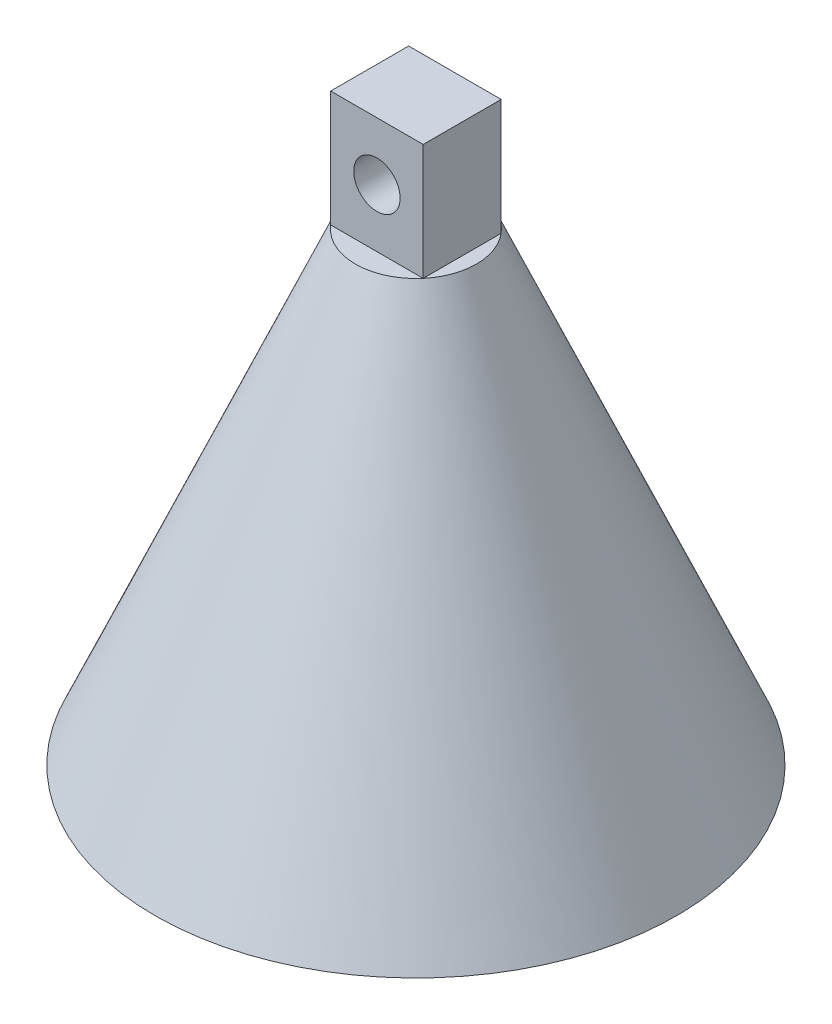
ISO-10303-21;
HEADER;
FILE_DESCRIPTION(('STEP AP214'),'2;1');
FILE_NAME('part.step','',(''),(''),'','','');
FILE_SCHEMA(('AUTOMOTIVE_DESIGN { 1 0 10303 214 1 1 1 1 }'));
ENDSEC;
DATA;
#1=APPLICATION_CONTEXT('core data for automotive mechanical design processes');
#2=APPLICATION_PROTOCOL_DEFINITION('international standard','automotive_design',2000,#1);
#3=PRODUCT_CONTEXT('',#1,'mechanical');
#4=PRODUCT('Part','Part','',(#3));
#5=PRODUCT_RELATED_PRODUCT_CATEGORY('part','',(#4));
#6=PRODUCT_DEFINITION_FORMATION('','',#4);
#7=PRODUCT_DEFINITION_CONTEXT('part definition',#1,'design');
#8=PRODUCT_DEFINITION('design','',#6,#7);
#9=PRODUCT_DEFINITION_SHAPE('','',#8);
#10=(LENGTH_UNIT() NAMED_UNIT(*) SI_UNIT(.MILLI.,.METRE.));
#11=(NAMED_UNIT(*) PLANE_ANGLE_UNIT() SI_UNIT($,.RADIAN.));
#12=(NAMED_UNIT(*) SI_UNIT($,.STERADIAN.) SOLID_ANGLE_UNIT());
#13=UNCERTAINTY_MEASURE_WITH_UNIT(LENGTH_MEASURE(1.E-05),#10,'distance_accuracy_value','');
#14=(GEOMETRIC_REPRESENTATION_CONTEXT(3) GLOBAL_UNCERTAINTY_ASSIGNED_CONTEXT((#13)) GLOBAL_UNIT_ASSIGNED_CONTEXT((#10,
#11,#12)) REPRESENTATION_CONTEXT('',''));
#15=CARTESIAN_POINT('',(0.,0.,0.));
#16=DIRECTION('',(0.,0.,1.));
#17=DIRECTION('',(1.,0.,0.));
#18=AXIS2_PLACEMENT_3D('',#15,#16,#17);
#19=CARTESIAN_POINT('',(0.,40.,0.));
#20=DIRECTION('',(0.,-1.,0.));
#21=DIRECTION('',(1.,0.,0.));
#22=AXIS2_PLACEMENT_3D('',#19,#20,#21);
#23=PLANE('',#22);
#24=CARTESIAN_POINT('',(22.5,40.,0.));
#25=DIRECTION('',(0.,1.,0.));
#26=DIRECTION('',(-1.,0.,0.));
#27=AXIS2_PLACEMENT_3D('',#24,#25,#26);
#28=CIRCLE('',#27,5.21486735339817);
#29=CARTESIAN_POINT('',(26.4876145118079,40.,3.36062077877841));
#30=VERTEX_POINT('',#29);
#31=CARTESIAN_POINT('',(26.4876145118079,40.,-3.36062077877841));
#32=VERTEX_POINT('',#31);
#33=EDGE_CURVE('E42',#30,#32,#28,.T.);
#34=ORIENTED_EDGE('',*,*,#33,.T.);
#35=DIRECTION('',(0.,0.,1.));
#36=VECTOR('',#35,1.);
#37=CARTESIAN_POINT('',(26.4876145118079,40.,-3.36062077877841));
#38=LINE('',#37,#36);
#39=EDGE_CURVE('E56',#32,#30,#38,.T.);
#40=ORIENTED_EDGE('',*,*,#39,.T.);
#41=EDGE_LOOP('',(#34,#40));
#42=FACE_BOUND('',#41,.T.);
#43=ADVANCED_FACE('F33',(#42),#23,.F.);
#44=DIRECTION('',(0.,0.,1.));
#45=VECTOR('',#44,1.);
#46=CARTESIAN_POINT('',(18.5123854881921,40.,-3.36062077877841));
#47=LINE('',#46,#45);
#48=CARTESIAN_POINT('',(18.5123854881921,40.,-3.36062077877841));
#49=VERTEX_POINT('',#48);
#50=CARTESIAN_POINT('',(18.5123854881921,40.,3.36062077877841));
#51=VERTEX_POINT('',#50);
#52=EDGE_CURVE('E102',#49,#51,#47,.T.);
#53=ORIENTED_EDGE('',*,*,#52,.F.);
#54=EDGE_CURVE('E43',#49,#51,#28,.T.);
#55=ORIENTED_EDGE('',*,*,#54,.T.);
#56=EDGE_LOOP('',(#53,#55));
#57=FACE_BOUND('',#56,.T.);
#58=ADVANCED_FACE('F140',(#57),#23,.F.);
#59=DIRECTION('',(-1.,0.,0.));
#60=VECTOR('',#59,1.);
#61=CARTESIAN_POINT('',(26.4876145118079,40.,-3.36062077877841));
#62=LINE('',#61,#60);
#63=EDGE_CURVE('E49',#32,#49,#62,.T.);
#64=ORIENTED_EDGE('',*,*,#63,.F.);
#65=EDGE_CURVE('E129',#32,#49,#28,.T.);
#66=ORIENTED_EDGE('',*,*,#65,.T.);
#67=EDGE_LOOP('',(#64,#66));
#68=FACE_BOUND('',#67,.T.);
#69=ADVANCED_FACE('F142',(#68),#23,.F.);
#70=EDGE_CURVE('E11',#51,#30,#28,.T.);
#71=ORIENTED_EDGE('',*,*,#70,.T.);
#72=DIRECTION('',(-1.,0.,0.));
#73=VECTOR('',#72,1.);
#74=CARTESIAN_POINT('',(26.4876145118079,40.,3.36062077877841));
#75=LINE('',#74,#73);
#76=EDGE_CURVE('E83',#30,#51,#75,.T.);
#77=ORIENTED_EDGE('',*,*,#76,.T.);
#78=EDGE_LOOP('',(#71,#77));
#79=FACE_BOUND('',#78,.T.);
#80=ADVANCED_FACE('F35',(#79),#23,.F.);
#81=CARTESIAN_POINT('',(22.5,0.,0.));
#82=DIRECTION('',(0.,-1.,0.));
#83=DIRECTION('',(1.,0.,0.));
#84=AXIS2_PLACEMENT_3D('',#81,#82,#83);
#85=CONICAL_SURFACE('',#84,22.5,0.407892869113481);
#86=ORIENTED_EDGE('',*,*,#70,.F.);
#87=ORIENTED_EDGE('',*,*,#54,.F.);
#88=ORIENTED_EDGE('',*,*,#65,.F.);
#89=ORIENTED_EDGE('',*,*,#33,.F.);
#90=EDGE_LOOP('',(#86,#87,#88,#89));
#91=FACE_BOUND('',#90,.T.);
#92=CARTESIAN_POINT('',(22.5,0.,0.));
#93=DIRECTION('',(0.,1.,0.));
#94=DIRECTION('',(-1.,0.,0.));
#95=AXIS2_PLACEMENT_3D('',#92,#93,#94);
#96=CIRCLE('',#95,22.5);
#97=CARTESIAN_POINT('',(0.,0.,0.));
#98=VERTEX_POINT('',#97);
#99=EDGE_CURVE('E124',#98,#98,#96,.T.);
#100=ORIENTED_EDGE('',*,*,#99,.T.);
#101=EDGE_LOOP('',(#100));
#102=FACE_BOUND('',#101,.T.);
#103=ADVANCED_FACE('F150',(#91,#102),#85,.T.);
#104=CARTESIAN_POINT('',(0.,0.,0.));
#105=DIRECTION('',(0.,-1.,0.));
#106=DIRECTION('',(1.,0.,0.));
#107=AXIS2_PLACEMENT_3D('',#104,#105,#106);
#108=PLANE('',#107);
#109=CARTESIAN_POINT('',(22.5,0.,0.));
#110=DIRECTION('',(0.,1.,0.));
#111=DIRECTION('',(-1.,0.,0.));
#112=AXIS2_PLACEMENT_3D('',#109,#110,#111);
#113=CIRCLE('',#112,20.5);
#114=CARTESIAN_POINT('',(2.,0.,0.));
#115=VERTEX_POINT('',#114);
#116=EDGE_CURVE('E121',#115,#115,#113,.T.);
#117=ORIENTED_EDGE('',*,*,#116,.T.);
#118=EDGE_LOOP('',(#117));
#119=FACE_BOUND('',#118,.T.);
#120=ORIENTED_EDGE('',*,*,#99,.F.);
#121=EDGE_LOOP('',(#120));
#122=FACE_BOUND('',#121,.T.);
#123=ADVANCED_FACE('F155',(#119,#122),#108,.T.);
#124=CARTESIAN_POINT('',(22.5,0.,0.));
#125=DIRECTION('',(0.,-1.,0.));
#126=DIRECTION('',(1.,0.,0.));
#127=AXIS2_PLACEMENT_3D('',#124,#125,#126);
#128=CONICAL_SURFACE('',#127,20.5,0.407892869113481);
#129=CARTESIAN_POINT('',(22.5,37.3619226530979,0.));
#130=DIRECTION('',(0.,1.,0.));
#131=DIRECTION('',(-1.,0.,0.));
#132=AXIS2_PLACEMENT_3D('',#129,#130,#131);
#133=CIRCLE('',#132,4.3548552752281);
#134=CARTESIAN_POINT('',(18.1451447247719,37.3619226530979,0.));
#135=VERTEX_POINT('',#134);
#136=EDGE_CURVE('E114',#135,#135,#133,.T.);
#137=ORIENTED_EDGE('',*,*,#136,.T.);
#138=EDGE_LOOP('',(#137));
#139=FACE_BOUND('',#138,.T.);
#140=ORIENTED_EDGE('',*,*,#116,.F.);
#141=EDGE_LOOP('',(#140));
#142=FACE_BOUND('',#141,.T.);
#143=ADVANCED_FACE('F159',(#139,#142),#128,.F.);
#144=CARTESIAN_POINT('',(0.,37.3619226530979,0.));
#145=DIRECTION('',(0.,-1.,0.));
#146=DIRECTION('',(1.,0.,0.));
#147=AXIS2_PLACEMENT_3D('',#144,#145,#146);
#148=PLANE('',#147);
#149=ORIENTED_EDGE('',*,*,#136,.F.);
#150=EDGE_LOOP('',(#149));
#151=FACE_BOUND('',#150,.T.);
#152=ADVANCED_FACE('F165',(#151),#148,.T.);
#153=CARTESIAN_POINT('',(26.4876145118079,50.,-3.36062077877841));
#154=DIRECTION('',(1.,0.,0.));
#155=DIRECTION('',(0.,1.,0.));
#156=AXIS2_PLACEMENT_3D('',#153,#154,#155);
#157=PLANE('',#156);
#158=ORIENTED_EDGE('',*,*,#39,.F.);
#159=DIRECTION('',(0.,-1.,0.));
#160=VECTOR('',#159,1.);
#161=CARTESIAN_POINT('',(26.4876145118079,50.,-3.36062077877841));
#162=LINE('',#161,#160);
#163=CARTESIAN_POINT('',(26.4876145118079,50.,-3.36062077877841));
#164=VERTEX_POINT('',#163);
#165=EDGE_CURVE('E99',#164,#32,#162,.T.);
#166=ORIENTED_EDGE('',*,*,#165,.F.);
#167=DIRECTION('',(0.,0.,1.));
#168=VECTOR('',#167,1.);
#169=CARTESIAN_POINT('',(26.4876145118079,50.,-3.36062077877841));
#170=LINE('',#169,#168);
#171=CARTESIAN_POINT('',(26.4876145118079,50.,3.36062077877841));
#172=VERTEX_POINT('',#171);
#173=EDGE_CURVE('E92',#164,#172,#170,.T.);
#174=ORIENTED_EDGE('',*,*,#173,.T.);
#175=DIRECTION('',(0.,-1.,0.));
#176=VECTOR('',#175,1.);
#177=CARTESIAN_POINT('',(26.4876145118079,50.,3.36062077877841));
#178=LINE('',#177,#176);
#179=EDGE_CURVE('E78',#172,#30,#178,.T.);
#180=ORIENTED_EDGE('',*,*,#179,.T.);
#181=EDGE_LOOP('',(#158,#166,#174,#180));
#182=FACE_BOUND('',#181,.T.);
#183=ADVANCED_FACE('F97',(#182),#157,.T.);
#184=CARTESIAN_POINT('',(26.4876145118079,50.,-3.36062077877841));
#185=DIRECTION('',(0.,0.,1.));
#186=DIRECTION('',(1.,0.,0.));
#187=AXIS2_PLACEMENT_3D('',#184,#185,#186);
#188=PLANE('',#187);
#189=CARTESIAN_POINT('',(22.5,45.,-3.36062077877841));
#190=DIRECTION('',(0.,0.,1.));
#191=DIRECTION('',(1.,0.,0.));
#192=AXIS2_PLACEMENT_3D('',#189,#190,#191);
#193=CIRCLE('',#192,2.);
#194=CARTESIAN_POINT('',(24.5,45.,-3.36062077877841));
#195=VERTEX_POINT('',#194);
#196=EDGE_CURVE('E105',#195,#195,#193,.F.);
#197=ORIENTED_EDGE('',*,*,#196,.F.);
#198=EDGE_LOOP('',(#197));
#199=FACE_BOUND('',#198,.T.);
#200=ORIENTED_EDGE('',*,*,#63,.T.);
#201=DIRECTION('',(0.,-1.,0.));
#202=VECTOR('',#201,1.);
#203=CARTESIAN_POINT('',(18.5123854881921,50.,-3.36062077877841));
#204=LINE('',#203,#202);
#205=CARTESIAN_POINT('',(18.5123854881921,50.,-3.36062077877841));
#206=VERTEX_POINT('',#205);
#207=EDGE_CURVE('E115',#206,#49,#204,.T.);
#208=ORIENTED_EDGE('',*,*,#207,.F.);
#209=DIRECTION('',(-1.,0.,0.));
#210=VECTOR('',#209,1.);
#211=CARTESIAN_POINT('',(26.4876145118079,50.,-3.36062077877841));
#212=LINE('',#211,#210);
#213=EDGE_CURVE('E87',#164,#206,#212,.T.);
#214=ORIENTED_EDGE('',*,*,#213,.F.);
#215=ORIENTED_EDGE('',*,*,#165,.T.);
#216=EDGE_LOOP('',(#200,#208,#214,#215));
#217=FACE_BOUND('',#216,.T.);
#218=ADVANCED_FACE('F136',(#199,#217),#188,.F.);
#219=CARTESIAN_POINT('',(18.5123854881921,50.,-3.36062077877841));
#220=DIRECTION('',(1.,0.,0.));
#221=DIRECTION('',(0.,1.,0.));
#222=AXIS2_PLACEMENT_3D('',#219,#220,#221);
#223=PLANE('',#222);
#224=ORIENTED_EDGE('',*,*,#52,.T.);
#225=DIRECTION('',(0.,-1.,0.));
#226=VECTOR('',#225,1.);
#227=CARTESIAN_POINT('',(18.5123854881921,50.,3.36062077877841));
#228=LINE('',#227,#226);
#229=CARTESIAN_POINT('',(18.5123854881921,50.,3.36062077877841));
#230=VERTEX_POINT('',#229);
#231=EDGE_CURVE('E86',#230,#51,#228,.T.);
#232=ORIENTED_EDGE('',*,*,#231,.F.);
#233=DIRECTION('',(0.,0.,1.));
#234=VECTOR('',#233,1.);
#235=CARTESIAN_POINT('',(18.5123854881921,50.,-3.36062077877841));
#236=LINE('',#235,#234);
#237=EDGE_CURVE('E94',#206,#230,#236,.T.);
#238=ORIENTED_EDGE('',*,*,#237,.F.);
#239=ORIENTED_EDGE('',*,*,#207,.T.);
#240=EDGE_LOOP('',(#224,#232,#238,#239));
#241=FACE_BOUND('',#240,.T.);
#242=ADVANCED_FACE('F139',(#241),#223,.F.);
#243=CARTESIAN_POINT('',(26.4876145118079,50.,3.36062077877841));
#244=DIRECTION('',(0.,0.,1.));
#245=DIRECTION('',(1.,0.,0.));
#246=AXIS2_PLACEMENT_3D('',#243,#244,#245);
#247=PLANE('',#246);
#248=CARTESIAN_POINT('',(22.5,45.,3.36062077877841));
#249=DIRECTION('',(0.,0.,1.));
#250=DIRECTION('',(1.,0.,0.));
#251=AXIS2_PLACEMENT_3D('',#248,#249,#250);
#252=CIRCLE('',#251,2.);
#253=CARTESIAN_POINT('',(24.5,45.,3.36062077877841));
#254=VERTEX_POINT('',#253);
#255=EDGE_CURVE('E37',#254,#254,#252,.F.);
#256=ORIENTED_EDGE('',*,*,#255,.T.);
#257=EDGE_LOOP('',(#256));
#258=FACE_BOUND('',#257,.T.);
#259=ORIENTED_EDGE('',*,*,#76,.F.);
#260=ORIENTED_EDGE('',*,*,#179,.F.);
#261=DIRECTION('',(-1.,0.,0.));
#262=VECTOR('',#261,1.);
#263=CARTESIAN_POINT('',(26.4876145118079,50.,3.36062077877841));
#264=LINE('',#263,#262);
#265=EDGE_CURVE('E82',#172,#230,#264,.T.);
#266=ORIENTED_EDGE('',*,*,#265,.T.);
#267=ORIENTED_EDGE('',*,*,#231,.T.);
#268=EDGE_LOOP('',(#259,#260,#266,#267));
#269=FACE_BOUND('',#268,.T.);
#270=ADVANCED_FACE('F80',(#258,#269),#247,.T.);
#271=CARTESIAN_POINT('',(0.,50.,0.));
#272=DIRECTION('',(0.,-1.,0.));
#273=DIRECTION('',(1.,0.,0.));
#274=AXIS2_PLACEMENT_3D('',#271,#272,#273);
#275=PLANE('',#274);
#276=ORIENTED_EDGE('',*,*,#173,.F.);
#277=ORIENTED_EDGE('',*,*,#213,.T.);
#278=ORIENTED_EDGE('',*,*,#237,.T.);
#279=ORIENTED_EDGE('',*,*,#265,.F.);
#280=EDGE_LOOP('',(#276,#277,#278,#279));
#281=FACE_BOUND('',#280,.T.);
#282=ADVANCED_FACE('F91',(#281),#275,.F.);
#283=CARTESIAN_POINT('',(22.5,45.,-17.3606207787784));
#284=DIRECTION('',(0.,0.,1.));
#285=DIRECTION('',(1.,0.,0.));
#286=AXIS2_PLACEMENT_3D('',#283,#284,#285);
#287=CYLINDRICAL_SURFACE('',#286,2.);
#288=ORIENTED_EDGE('',*,*,#255,.F.);
#289=EDGE_LOOP('',(#288));
#290=FACE_BOUND('',#289,.T.);
#291=ORIENTED_EDGE('',*,*,#196,.T.);
#292=EDGE_LOOP('',(#291));
#293=FACE_BOUND('',#292,.T.);
#294=ADVANCED_FACE('F182',(#290,#293),#287,.F.);
#295=CLOSED_SHELL('',(#43,#58,#69,#80,#103,#123,#143,#152,#183,#218,#242,#270,#282,#294));
#296=MANIFOLD_SOLID_BREP('B2',#295);
#297=ADVANCED_BREP_SHAPE_REPRESENTATION('',(#18,#296),#14);
#298=SHAPE_DEFINITION_REPRESENTATION(#9,#297);
ENDSEC;
END-ISO-10303-21;
